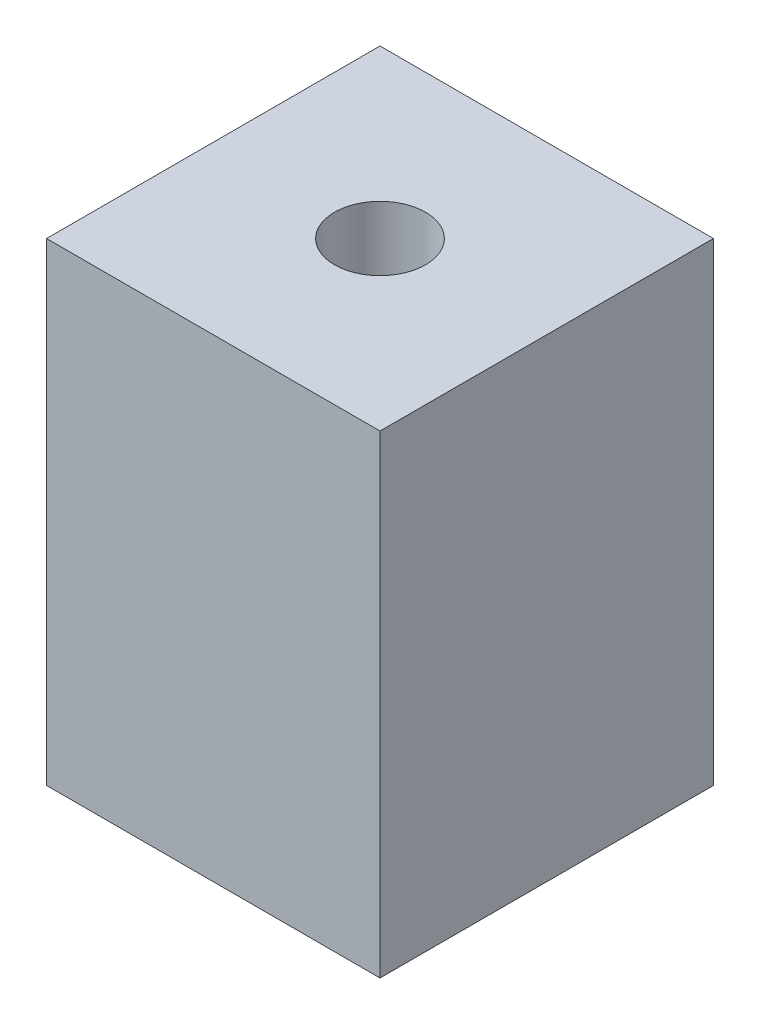
ISO-10303-21;
HEADER;
FILE_DESCRIPTION(('STEP AP214'),'2;1');
FILE_NAME('part.step','',(''),(''),'','','');
FILE_SCHEMA(('AUTOMOTIVE_DESIGN { 1 0 10303 214 1 1 1 1 }'));
ENDSEC;
DATA;
#1=APPLICATION_CONTEXT('core data for automotive mechanical design processes');
#2=APPLICATION_PROTOCOL_DEFINITION('international standard','automotive_design',2000,#1);
#3=PRODUCT_CONTEXT('',#1,'mechanical');
#4=PRODUCT('Part','Part','',(#3));
#5=PRODUCT_RELATED_PRODUCT_CATEGORY('part','',(#4));
#6=PRODUCT_DEFINITION_FORMATION('','',#4);
#7=PRODUCT_DEFINITION_CONTEXT('part definition',#1,'design');
#8=PRODUCT_DEFINITION('design','',#6,#7);
#9=PRODUCT_DEFINITION_SHAPE('','',#8);
#10=(LENGTH_UNIT() NAMED_UNIT(*) SI_UNIT(.MILLI.,.METRE.));
#11=(NAMED_UNIT(*) PLANE_ANGLE_UNIT() SI_UNIT($,.RADIAN.));
#12=(NAMED_UNIT(*) SI_UNIT($,.STERADIAN.) SOLID_ANGLE_UNIT());
#13=UNCERTAINTY_MEASURE_WITH_UNIT(LENGTH_MEASURE(1.E-05),#10,'distance_accuracy_value','');
#14=(GEOMETRIC_REPRESENTATION_CONTEXT(3) GLOBAL_UNCERTAINTY_ASSIGNED_CONTEXT((#13)) GLOBAL_UNIT_ASSIGNED_CONTEXT((#10,
#11,#12)) REPRESENTATION_CONTEXT('',''));
#15=CARTESIAN_POINT('',(0.,0.,0.));
#16=DIRECTION('',(0.,0.,1.));
#17=DIRECTION('',(1.,0.,0.));
#18=AXIS2_PLACEMENT_3D('',#15,#16,#17);
#19=CARTESIAN_POINT('',(23.241,66.04,-23.241));
#20=DIRECTION('',(-1.,0.,0.));
#21=DIRECTION('',(0.,0.,1.));
#22=AXIS2_PLACEMENT_3D('',#19,#20,#21);
#23=PLANE('',#22);
#24=DIRECTION('',(0.,0.,-1.));
#25=VECTOR('',#24,1.);
#26=CARTESIAN_POINT('',(23.241,0.,-23.241));
#27=LINE('',#26,#25);
#28=CARTESIAN_POINT('',(23.241,0.,23.241));
#29=VERTEX_POINT('',#28);
#30=CARTESIAN_POINT('',(23.241,0.,-23.241));
#31=VERTEX_POINT('',#30);
#32=EDGE_CURVE('E95',#29,#31,#27,.T.);
#33=ORIENTED_EDGE('',*,*,#32,.T.);
#34=DIRECTION('',(0.,-1.,0.));
#35=VECTOR('',#34,1.);
#36=CARTESIAN_POINT('',(23.241,66.04,-23.241));
#37=LINE('',#36,#35);
#38=CARTESIAN_POINT('',(23.241,66.04,-23.241));
#39=VERTEX_POINT('',#38);
#40=EDGE_CURVE('E11',#39,#31,#37,.T.);
#41=ORIENTED_EDGE('',*,*,#40,.F.);
#42=DIRECTION('',(0.,0.,-1.));
#43=VECTOR('',#42,1.);
#44=CARTESIAN_POINT('',(23.241,66.04,-23.241));
#45=LINE('',#44,#43);
#46=CARTESIAN_POINT('',(23.241,66.04,23.241));
#47=VERTEX_POINT('',#46);
#48=EDGE_CURVE('E83',#47,#39,#45,.T.);
#49=ORIENTED_EDGE('',*,*,#48,.F.);
#50=DIRECTION('',(0.,-1.,0.));
#51=VECTOR('',#50,1.);
#52=CARTESIAN_POINT('',(23.241,66.04,23.241));
#53=LINE('',#52,#51);
#54=EDGE_CURVE('E91',#47,#29,#53,.T.);
#55=ORIENTED_EDGE('',*,*,#54,.T.);
#56=EDGE_LOOP('',(#33,#41,#49,#55));
#57=FACE_BOUND('',#56,.T.);
#58=ADVANCED_FACE('F32',(#57),#23,.F.);
#59=CARTESIAN_POINT('',(-23.241,66.04,-23.241));
#60=DIRECTION('',(0.,0.,1.));
#61=DIRECTION('',(1.,0.,0.));
#62=AXIS2_PLACEMENT_3D('',#59,#60,#61);
#63=PLANE('',#62);
#64=DIRECTION('',(-1.,0.,0.));
#65=VECTOR('',#64,1.);
#66=CARTESIAN_POINT('',(-23.241,0.,-23.241));
#67=LINE('',#66,#65);
#68=CARTESIAN_POINT('',(-23.241,0.,-23.241));
#69=VERTEX_POINT('',#68);
#70=EDGE_CURVE('E87',#31,#69,#67,.T.);
#71=ORIENTED_EDGE('',*,*,#70,.T.);
#72=DIRECTION('',(0.,-1.,0.));
#73=VECTOR('',#72,1.);
#74=CARTESIAN_POINT('',(-23.241,66.04,-23.241));
#75=LINE('',#74,#73);
#76=CARTESIAN_POINT('',(-23.241,66.04,-23.241));
#77=VERTEX_POINT('',#76);
#78=EDGE_CURVE('E40',#77,#69,#75,.T.);
#79=ORIENTED_EDGE('',*,*,#78,.F.);
#80=DIRECTION('',(-1.,0.,0.));
#81=VECTOR('',#80,1.);
#82=CARTESIAN_POINT('',(-23.241,66.04,-23.241));
#83=LINE('',#82,#81);
#84=EDGE_CURVE('E78',#39,#77,#83,.T.);
#85=ORIENTED_EDGE('',*,*,#84,.F.);
#86=ORIENTED_EDGE('',*,*,#40,.T.);
#87=EDGE_LOOP('',(#71,#79,#85,#86));
#88=FACE_BOUND('',#87,.T.);
#89=ADVANCED_FACE('F86',(#88),#63,.F.);
#90=CARTESIAN_POINT('',(-23.241,66.04,-23.241));
#91=DIRECTION('',(1.,0.,0.));
#92=DIRECTION('',(0.,0.,-1.));
#93=AXIS2_PLACEMENT_3D('',#90,#91,#92);
#94=PLANE('',#93);
#95=DIRECTION('',(0.,0.,1.));
#96=VECTOR('',#95,1.);
#97=CARTESIAN_POINT('',(-23.241,0.,-23.241));
#98=LINE('',#97,#96);
#99=CARTESIAN_POINT('',(-23.241,0.,23.241));
#100=VERTEX_POINT('',#99);
#101=EDGE_CURVE('E65',#69,#100,#98,.T.);
#102=ORIENTED_EDGE('',*,*,#101,.T.);
#103=DIRECTION('',(0.,-1.,0.));
#104=VECTOR('',#103,1.);
#105=CARTESIAN_POINT('',(-23.241,66.04,23.241));
#106=LINE('',#105,#104);
#107=CARTESIAN_POINT('',(-23.241,66.04,23.241));
#108=VERTEX_POINT('',#107);
#109=EDGE_CURVE('E88',#108,#100,#106,.T.);
#110=ORIENTED_EDGE('',*,*,#109,.F.);
#111=DIRECTION('',(0.,0.,1.));
#112=VECTOR('',#111,1.);
#113=CARTESIAN_POINT('',(-23.241,66.04,-23.241));
#114=LINE('',#113,#112);
#115=EDGE_CURVE('E81',#77,#108,#114,.T.);
#116=ORIENTED_EDGE('',*,*,#115,.F.);
#117=ORIENTED_EDGE('',*,*,#78,.T.);
#118=EDGE_LOOP('',(#102,#110,#116,#117));
#119=FACE_BOUND('',#118,.T.);
#120=ADVANCED_FACE('F89',(#119),#94,.F.);
#121=CARTESIAN_POINT('',(-23.241,66.04,23.241));
#122=DIRECTION('',(0.,0.,-1.));
#123=DIRECTION('',(-1.,0.,0.));
#124=AXIS2_PLACEMENT_3D('',#121,#122,#123);
#125=PLANE('',#124);
#126=DIRECTION('',(1.,0.,0.));
#127=VECTOR('',#126,1.);
#128=CARTESIAN_POINT('',(-23.241,0.,23.241));
#129=LINE('',#128,#127);
#130=EDGE_CURVE('E71',#100,#29,#129,.T.);
#131=ORIENTED_EDGE('',*,*,#130,.T.);
#132=ORIENTED_EDGE('',*,*,#54,.F.);
#133=DIRECTION('',(1.,0.,0.));
#134=VECTOR('',#133,1.);
#135=CARTESIAN_POINT('',(-23.241,66.04,23.241));
#136=LINE('',#135,#134);
#137=EDGE_CURVE('E48',#108,#47,#136,.T.);
#138=ORIENTED_EDGE('',*,*,#137,.F.);
#139=ORIENTED_EDGE('',*,*,#109,.T.);
#140=EDGE_LOOP('',(#131,#132,#138,#139));
#141=FACE_BOUND('',#140,.T.);
#142=ADVANCED_FACE('F103',(#141),#125,.F.);
#143=CARTESIAN_POINT('',(0.,66.04,0.));
#144=DIRECTION('',(0.,1.,0.));
#145=DIRECTION('',(0.,0.,1.));
#146=AXIS2_PLACEMENT_3D('',#143,#144,#145);
#147=PLANE('',#146);
#148=CARTESIAN_POINT('',(0.,66.04,0.));
#149=DIRECTION('',(0.,1.,0.));
#150=DIRECTION('',(0.,0.,1.));
#151=AXIS2_PLACEMENT_3D('',#148,#149,#150);
#152=CIRCLE('',#151,6.35);
#153=CARTESIAN_POINT('',(0.,66.04,6.35));
#154=VERTEX_POINT('',#153);
#155=EDGE_CURVE('E109',#154,#154,#152,.T.);
#156=ORIENTED_EDGE('',*,*,#155,.F.);
#157=EDGE_LOOP('',(#156));
#158=FACE_BOUND('',#157,.T.);
#159=ORIENTED_EDGE('',*,*,#48,.T.);
#160=ORIENTED_EDGE('',*,*,#84,.T.);
#161=ORIENTED_EDGE('',*,*,#115,.T.);
#162=ORIENTED_EDGE('',*,*,#137,.T.);
#163=EDGE_LOOP('',(#159,#160,#161,#162));
#164=FACE_BOUND('',#163,.T.);
#165=ADVANCED_FACE('F79',(#158,#164),#147,.T.);
#166=CARTESIAN_POINT('',(0.,0.,0.));
#167=DIRECTION('',(0.,1.,0.));
#168=DIRECTION('',(0.,0.,1.));
#169=AXIS2_PLACEMENT_3D('',#166,#167,#168);
#170=PLANE('',#169);
#171=CARTESIAN_POINT('',(0.,0.,0.));
#172=DIRECTION('',(0.,-1.,0.));
#173=DIRECTION('',(0.,0.,-1.));
#174=AXIS2_PLACEMENT_3D('',#171,#172,#173);
#175=CIRCLE('',#174,6.35);
#176=CARTESIAN_POINT('',(0.,0.,-6.35));
#177=VERTEX_POINT('',#176);
#178=EDGE_CURVE('E115',#177,#177,#175,.T.);
#179=ORIENTED_EDGE('',*,*,#178,.F.);
#180=EDGE_LOOP('',(#179));
#181=FACE_BOUND('',#180,.T.);
#182=ORIENTED_EDGE('',*,*,#32,.F.);
#183=ORIENTED_EDGE('',*,*,#130,.F.);
#184=ORIENTED_EDGE('',*,*,#101,.F.);
#185=ORIENTED_EDGE('',*,*,#70,.F.);
#186=EDGE_LOOP('',(#182,#183,#184,#185));
#187=FACE_BOUND('',#186,.T.);
#188=ADVANCED_FACE('F106',(#181,#187),#170,.F.);
#189=CARTESIAN_POINT('',(0.,53.34,0.));
#190=DIRECTION('',(0.,1.,0.));
#191=DIRECTION('',(0.,0.,1.));
#192=AXIS2_PLACEMENT_3D('',#189,#190,#191);
#193=CYLINDRICAL_SURFACE('',#192,6.35);
#194=CARTESIAN_POINT('',(0.,53.34,0.));
#195=DIRECTION('',(0.,1.,0.));
#196=DIRECTION('',(0.,0.,1.));
#197=AXIS2_PLACEMENT_3D('',#194,#195,#196);
#198=CIRCLE('',#197,6.35);
#199=CARTESIAN_POINT('',(0.,53.34,6.35));
#200=VERTEX_POINT('',#199);
#201=EDGE_CURVE('E98',#200,#200,#198,.T.);
#202=ORIENTED_EDGE('',*,*,#201,.F.);
#203=EDGE_LOOP('',(#202));
#204=FACE_BOUND('',#203,.T.);
#205=ORIENTED_EDGE('',*,*,#155,.T.);
#206=EDGE_LOOP('',(#205));
#207=FACE_BOUND('',#206,.T.);
#208=ADVANCED_FACE('F131',(#204,#207),#193,.F.);
#209=CARTESIAN_POINT('',(0.,53.34,0.));
#210=DIRECTION('',(0.,1.,0.));
#211=DIRECTION('',(0.,0.,1.));
#212=AXIS2_PLACEMENT_3D('',#209,#210,#211);
#213=PLANE('',#212);
#214=ORIENTED_EDGE('',*,*,#201,.T.);
#215=EDGE_LOOP('',(#214));
#216=FACE_BOUND('',#215,.T.);
#217=ADVANCED_FACE('F126',(#216),#213,.T.);
#218=CARTESIAN_POINT('',(0.,12.7,0.));
#219=DIRECTION('',(0.,-1.,0.));
#220=DIRECTION('',(0.,0.,-1.));
#221=AXIS2_PLACEMENT_3D('',#218,#219,#220);
#222=CYLINDRICAL_SURFACE('',#221,6.35);
#223=CARTESIAN_POINT('',(0.,12.7,0.));
#224=DIRECTION('',(0.,-1.,0.));
#225=DIRECTION('',(0.,0.,-1.));
#226=AXIS2_PLACEMENT_3D('',#223,#224,#225);
#227=CIRCLE('',#226,6.35);
#228=CARTESIAN_POINT('',(0.,12.7,-6.35));
#229=VERTEX_POINT('',#228);
#230=EDGE_CURVE('E112',#229,#229,#227,.T.);
#231=ORIENTED_EDGE('',*,*,#230,.F.);
#232=EDGE_LOOP('',(#231));
#233=FACE_BOUND('',#232,.T.);
#234=ORIENTED_EDGE('',*,*,#178,.T.);
#235=EDGE_LOOP('',(#234));
#236=FACE_BOUND('',#235,.T.);
#237=ADVANCED_FACE('F123',(#233,#236),#222,.F.);
#238=CARTESIAN_POINT('',(0.,12.7,0.));
#239=DIRECTION('',(0.,-1.,0.));
#240=DIRECTION('',(0.,0.,-1.));
#241=AXIS2_PLACEMENT_3D('',#238,#239,#240);
#242=PLANE('',#241);
#243=ORIENTED_EDGE('',*,*,#230,.T.);
#244=EDGE_LOOP('',(#243));
#245=FACE_BOUND('',#244,.T.);
#246=ADVANCED_FACE('F121',(#245),#242,.T.);
#247=CLOSED_SHELL('',(#58,#89,#120,#142,#165,#188,#208,#217,#237,#246));
#248=MANIFOLD_SOLID_BREP('B2',#247);
#249=ADVANCED_BREP_SHAPE_REPRESENTATION('',(#18,#248),#14);
#250=SHAPE_DEFINITION_REPRESENTATION(#9,#249);
ENDSEC;
END-ISO-10303-21;
